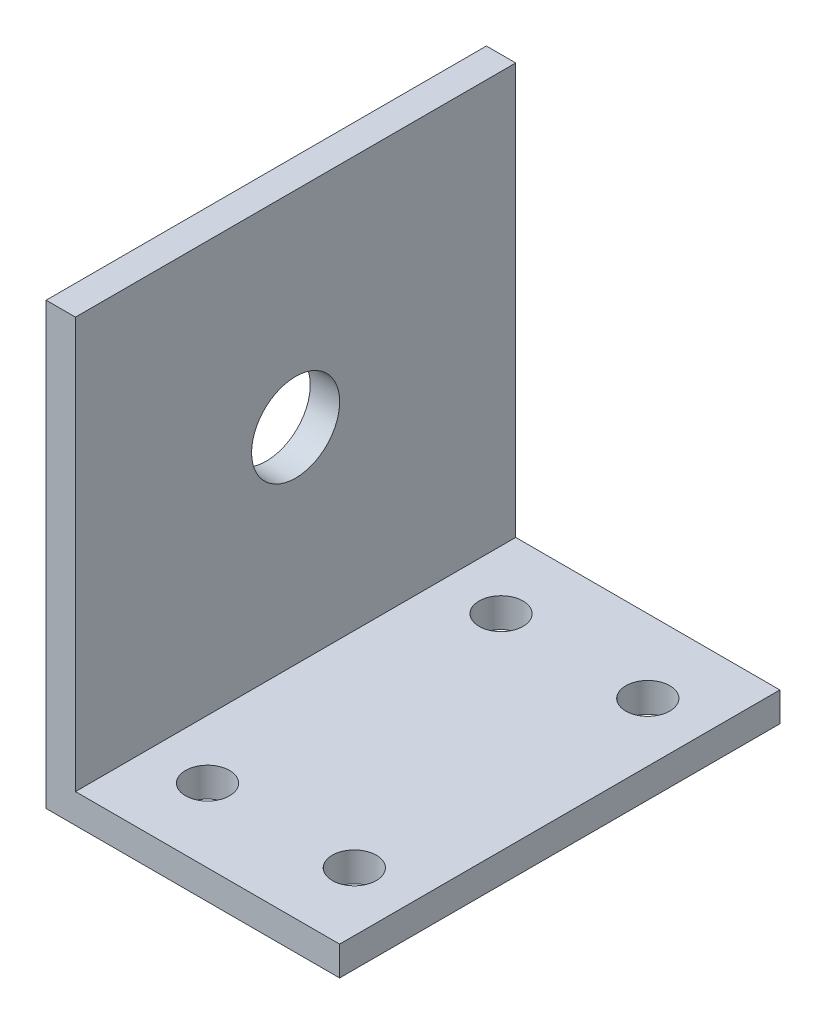
ISO-10303-21;
HEADER;
FILE_DESCRIPTION(('STEP AP214'),'2;1');
FILE_NAME('part.step','',(''),(''),'','','');
FILE_SCHEMA(('AUTOMOTIVE_DESIGN { 1 0 10303 214 1 1 1 1 }'));
ENDSEC;
DATA;
#1=APPLICATION_CONTEXT('core data for automotive mechanical design processes');
#2=APPLICATION_PROTOCOL_DEFINITION('international standard','automotive_design',2000,#1);
#3=PRODUCT_CONTEXT('',#1,'mechanical');
#4=PRODUCT('Part','Part','',(#3));
#5=PRODUCT_RELATED_PRODUCT_CATEGORY('part','',(#4));
#6=PRODUCT_DEFINITION_FORMATION('','',#4);
#7=PRODUCT_DEFINITION_CONTEXT('part definition',#1,'design');
#8=PRODUCT_DEFINITION('design','',#6,#7);
#9=PRODUCT_DEFINITION_SHAPE('','',#8);
#10=(LENGTH_UNIT() NAMED_UNIT(*) SI_UNIT(.MILLI.,.METRE.));
#11=(NAMED_UNIT(*) PLANE_ANGLE_UNIT() SI_UNIT($,.RADIAN.));
#12=(NAMED_UNIT(*) SI_UNIT($,.STERADIAN.) SOLID_ANGLE_UNIT());
#13=UNCERTAINTY_MEASURE_WITH_UNIT(LENGTH_MEASURE(1.E-05),#10,'distance_accuracy_value','');
#14=(GEOMETRIC_REPRESENTATION_CONTEXT(3) GLOBAL_UNCERTAINTY_ASSIGNED_CONTEXT((#13)) GLOBAL_UNIT_ASSIGNED_CONTEXT((#10,
#11,#12)) REPRESENTATION_CONTEXT('',''));
#15=CARTESIAN_POINT('',(0.,0.,0.));
#16=DIRECTION('',(0.,0.,1.));
#17=DIRECTION('',(1.,0.,0.));
#18=AXIS2_PLACEMENT_3D('',#15,#16,#17);
#19=CARTESIAN_POINT('',(0.,0.,20.));
#20=DIRECTION('',(0.,0.,-1.));
#21=DIRECTION('',(-1.,0.,0.));
#22=AXIS2_PLACEMENT_3D('',#19,#20,#21);
#23=PLANE('',#22);
#24=DIRECTION('',(0.,-1.,0.));
#25=VECTOR('',#24,1.);
#26=CARTESIAN_POINT('',(20.,1.99999999999999,20.));
#27=LINE('',#26,#25);
#28=CARTESIAN_POINT('',(20.,1.99999999999999,20.));
#29=VERTEX_POINT('',#28);
#30=CARTESIAN_POINT('',(20.,0.,20.));
#31=VERTEX_POINT('',#30);
#32=EDGE_CURVE('E148',#29,#31,#27,.T.);
#33=ORIENTED_EDGE('',*,*,#32,.F.);
#34=DIRECTION('',(1.,0.,0.));
#35=VECTOR('',#34,1.);
#36=CARTESIAN_POINT('',(3.,1.99999999999999,20.));
#37=LINE('',#36,#35);
#38=CARTESIAN_POINT('',(2.,1.99999999999999,20.));
#39=VERTEX_POINT('',#38);
#40=EDGE_CURVE('E161',#39,#29,#37,.T.);
#41=ORIENTED_EDGE('',*,*,#40,.F.);
#42=DIRECTION('',(0.,-1.,0.));
#43=VECTOR('',#42,1.);
#44=CARTESIAN_POINT('',(2.,30.,20.));
#45=LINE('',#44,#43);
#46=CARTESIAN_POINT('',(2.,30.,20.));
#47=VERTEX_POINT('',#46);
#48=EDGE_CURVE('E119',#47,#39,#45,.T.);
#49=ORIENTED_EDGE('',*,*,#48,.F.);
#50=DIRECTION('',(1.,0.,0.));
#51=VECTOR('',#50,1.);
#52=CARTESIAN_POINT('',(3.,30.,20.));
#53=LINE('',#52,#51);
#54=CARTESIAN_POINT('',(0.,30.,20.));
#55=VERTEX_POINT('',#54);
#56=EDGE_CURVE('E164',#55,#47,#53,.T.);
#57=ORIENTED_EDGE('',*,*,#56,.F.);
#58=DIRECTION('',(0.,-1.,0.));
#59=VECTOR('',#58,1.);
#60=CARTESIAN_POINT('',(0.,0.,20.));
#61=LINE('',#60,#59);
#62=CARTESIAN_POINT('',(0.,0.,20.));
#63=VERTEX_POINT('',#62);
#64=EDGE_CURVE('E67',#55,#63,#61,.T.);
#65=ORIENTED_EDGE('',*,*,#64,.T.);
#66=DIRECTION('',(1.,0.,0.));
#67=VECTOR('',#66,1.);
#68=CARTESIAN_POINT('',(38.,0.,20.));
#69=LINE('',#68,#67);
#70=EDGE_CURVE('E169',#63,#31,#69,.T.);
#71=ORIENTED_EDGE('',*,*,#70,.T.);
#72=EDGE_LOOP('',(#33,#41,#49,#57,#65,#71));
#73=FACE_BOUND('',#72,.T.);
#74=ADVANCED_FACE('F59',(#73),#23,.F.);
#75=CARTESIAN_POINT('',(38.,0.,20.));
#76=DIRECTION('',(0.,1.,0.));
#77=DIRECTION('',(0.,0.,1.));
#78=AXIS2_PLACEMENT_3D('',#75,#76,#77);
#79=PLANE('',#78);
#80=CARTESIAN_POINT('',(16.,0.,-5.));
#81=DIRECTION('',(0.,1.,0.));
#82=DIRECTION('',(0.,0.,1.));
#83=AXIS2_PLACEMENT_3D('',#80,#81,#82);
#84=CIRCLE('',#83,1.5);
#85=CARTESIAN_POINT('',(16.,0.,-3.5));
#86=VERTEX_POINT('',#85);
#87=EDGE_CURVE('E136',#86,#86,#84,.T.);
#88=ORIENTED_EDGE('',*,*,#87,.T.);
#89=EDGE_LOOP('',(#88));
#90=FACE_BOUND('',#89,.T.);
#91=CARTESIAN_POINT('',(6.,0.,15.));
#92=DIRECTION('',(0.,1.,0.));
#93=DIRECTION('',(0.,0.,1.));
#94=AXIS2_PLACEMENT_3D('',#91,#92,#93);
#95=CIRCLE('',#94,1.5);
#96=CARTESIAN_POINT('',(6.,0.,16.5));
#97=VERTEX_POINT('',#96);
#98=EDGE_CURVE('E208',#97,#97,#95,.T.);
#99=ORIENTED_EDGE('',*,*,#98,.T.);
#100=EDGE_LOOP('',(#99));
#101=FACE_BOUND('',#100,.T.);
#102=CARTESIAN_POINT('',(6.,0.,-5.));
#103=DIRECTION('',(0.,1.,0.));
#104=DIRECTION('',(0.,0.,1.));
#105=AXIS2_PLACEMENT_3D('',#102,#103,#104);
#106=CIRCLE('',#105,1.5);
#107=CARTESIAN_POINT('',(6.,0.,-3.5));
#108=VERTEX_POINT('',#107);
#109=EDGE_CURVE('E212',#108,#108,#106,.T.);
#110=ORIENTED_EDGE('',*,*,#109,.T.);
#111=EDGE_LOOP('',(#110));
#112=FACE_BOUND('',#111,.T.);
#113=CARTESIAN_POINT('',(16.,0.,15.));
#114=DIRECTION('',(0.,1.,0.));
#115=DIRECTION('',(0.,0.,1.));
#116=AXIS2_PLACEMENT_3D('',#113,#114,#115);
#117=CIRCLE('',#116,1.5);
#118=CARTESIAN_POINT('',(16.,0.,16.5));
#119=VERTEX_POINT('',#118);
#120=EDGE_CURVE('E215',#119,#119,#117,.T.);
#121=ORIENTED_EDGE('',*,*,#120,.T.);
#122=EDGE_LOOP('',(#121));
#123=FACE_BOUND('',#122,.T.);
#124=DIRECTION('',(0.,0.,-1.));
#125=VECTOR('',#124,1.);
#126=CARTESIAN_POINT('',(20.,0.,20.));
#127=LINE('',#126,#125);
#128=CARTESIAN_POINT('',(20.,0.,-10.));
#129=VERTEX_POINT('',#128);
#130=EDGE_CURVE('E153',#31,#129,#127,.T.);
#131=ORIENTED_EDGE('',*,*,#130,.F.);
#132=ORIENTED_EDGE('',*,*,#70,.F.);
#133=DIRECTION('',(0.,0.,-1.));
#134=VECTOR('',#133,1.);
#135=CARTESIAN_POINT('',(0.,0.,20.));
#136=LINE('',#135,#134);
#137=CARTESIAN_POINT('',(0.,0.,-10.));
#138=VERTEX_POINT('',#137);
#139=EDGE_CURVE('E12',#63,#138,#136,.T.);
#140=ORIENTED_EDGE('',*,*,#139,.T.);
#141=DIRECTION('',(-1.,0.,0.));
#142=VECTOR('',#141,1.);
#143=CARTESIAN_POINT('',(0.,0.,-10.));
#144=LINE('',#143,#142);
#145=EDGE_CURVE('E142',#129,#138,#144,.T.);
#146=ORIENTED_EDGE('',*,*,#145,.F.);
#147=EDGE_LOOP('',(#131,#132,#140,#146));
#148=FACE_BOUND('',#147,.T.);
#149=ADVANCED_FACE('F61',(#90,#101,#112,#123,#148),#79,.F.);
#150=CARTESIAN_POINT('',(0.,1.99999999999999,0.));
#151=DIRECTION('',(0.,-1.,0.));
#152=DIRECTION('',(0.,0.,-1.));
#153=AXIS2_PLACEMENT_3D('',#150,#151,#152);
#154=PLANE('',#153);
#155=CARTESIAN_POINT('',(16.,1.99999999999999,-5.));
#156=DIRECTION('',(0.,1.,0.));
#157=DIRECTION('',(0.,0.,1.));
#158=AXIS2_PLACEMENT_3D('',#155,#156,#157);
#159=CIRCLE('',#158,1.5);
#160=CARTESIAN_POINT('',(16.,1.99999999999999,-3.5));
#161=VERTEX_POINT('',#160);
#162=EDGE_CURVE('E221',#161,#161,#159,.T.);
#163=ORIENTED_EDGE('',*,*,#162,.F.);
#164=EDGE_LOOP('',(#163));
#165=FACE_BOUND('',#164,.T.);
#166=CARTESIAN_POINT('',(6.,1.99999999999999,15.));
#167=DIRECTION('',(0.,1.,0.));
#168=DIRECTION('',(0.,0.,1.));
#169=AXIS2_PLACEMENT_3D('',#166,#167,#168);
#170=CIRCLE('',#169,1.5);
#171=CARTESIAN_POINT('',(6.,1.99999999999999,16.5));
#172=VERTEX_POINT('',#171);
#173=EDGE_CURVE('E224',#172,#172,#170,.T.);
#174=ORIENTED_EDGE('',*,*,#173,.F.);
#175=EDGE_LOOP('',(#174));
#176=FACE_BOUND('',#175,.T.);
#177=CARTESIAN_POINT('',(6.,1.99999999999999,-5.));
#178=DIRECTION('',(0.,1.,0.));
#179=DIRECTION('',(0.,0.,1.));
#180=AXIS2_PLACEMENT_3D('',#177,#178,#179);
#181=CIRCLE('',#180,1.5);
#182=CARTESIAN_POINT('',(6.,1.99999999999999,-3.5));
#183=VERTEX_POINT('',#182);
#184=EDGE_CURVE('E227',#183,#183,#181,.T.);
#185=ORIENTED_EDGE('',*,*,#184,.F.);
#186=EDGE_LOOP('',(#185));
#187=FACE_BOUND('',#186,.T.);
#188=CARTESIAN_POINT('',(16.,1.99999999999999,15.));
#189=DIRECTION('',(0.,1.,0.));
#190=DIRECTION('',(0.,0.,1.));
#191=AXIS2_PLACEMENT_3D('',#188,#189,#190);
#192=CIRCLE('',#191,1.5);
#193=CARTESIAN_POINT('',(16.,1.99999999999999,16.5));
#194=VERTEX_POINT('',#193);
#195=EDGE_CURVE('E217',#194,#194,#192,.T.);
#196=ORIENTED_EDGE('',*,*,#195,.F.);
#197=EDGE_LOOP('',(#196));
#198=FACE_BOUND('',#197,.T.);
#199=DIRECTION('',(0.,0.,1.));
#200=VECTOR('',#199,1.);
#201=CARTESIAN_POINT('',(20.,1.99999999999999,20.));
#202=LINE('',#201,#200);
#203=CARTESIAN_POINT('',(20.,1.99999999999999,-10.));
#204=VERTEX_POINT('',#203);
#205=EDGE_CURVE('E139',#204,#29,#202,.T.);
#206=ORIENTED_EDGE('',*,*,#205,.F.);
#207=DIRECTION('',(1.,0.,0.));
#208=VECTOR('',#207,1.);
#209=CARTESIAN_POINT('',(0.,1.99999999999999,-10.));
#210=LINE('',#209,#208);
#211=CARTESIAN_POINT('',(2.,1.99999999999999,-10.));
#212=VERTEX_POINT('',#211);
#213=EDGE_CURVE('E131',#212,#204,#210,.T.);
#214=ORIENTED_EDGE('',*,*,#213,.F.);
#215=DIRECTION('',(0.,0.,-1.));
#216=VECTOR('',#215,1.);
#217=CARTESIAN_POINT('',(2.,1.99999999999999,20.));
#218=LINE('',#217,#216);
#219=EDGE_CURVE('E113',#39,#212,#218,.T.);
#220=ORIENTED_EDGE('',*,*,#219,.F.);
#221=ORIENTED_EDGE('',*,*,#40,.T.);
#222=EDGE_LOOP('',(#206,#214,#220,#221));
#223=FACE_BOUND('',#222,.T.);
#224=ADVANCED_FACE('F138',(#165,#176,#187,#198,#223),#154,.F.);
#225=CARTESIAN_POINT('',(38.,16.,5.));
#226=DIRECTION('',(-1.,0.,0.));
#227=DIRECTION('',(0.,0.,1.));
#228=AXIS2_PLACEMENT_3D('',#225,#226,#227);
#229=CYLINDRICAL_SURFACE('',#228,3.);
#230=CARTESIAN_POINT('',(0.,16.,5.));
#231=DIRECTION('',(-1.,0.,0.));
#232=DIRECTION('',(0.,0.,1.));
#233=AXIS2_PLACEMENT_3D('',#230,#231,#232);
#234=CIRCLE('',#233,3.);
#235=CARTESIAN_POINT('',(0.,16.,8.));
#236=VERTEX_POINT('',#235);
#237=EDGE_CURVE('E166',#236,#236,#234,.T.);
#238=ORIENTED_EDGE('',*,*,#237,.T.);
#239=EDGE_LOOP('',(#238));
#240=FACE_BOUND('',#239,.T.);
#241=CARTESIAN_POINT('',(2.,16.,5.));
#242=DIRECTION('',(1.,0.,0.));
#243=DIRECTION('',(0.,0.,-1.));
#244=AXIS2_PLACEMENT_3D('',#241,#242,#243);
#245=CIRCLE('',#244,3.);
#246=CARTESIAN_POINT('',(2.,16.,2.));
#247=VERTEX_POINT('',#246);
#248=EDGE_CURVE('E158',#247,#247,#245,.F.);
#249=ORIENTED_EDGE('',*,*,#248,.F.);
#250=EDGE_LOOP('',(#249));
#251=FACE_BOUND('',#250,.T.);
#252=ADVANCED_FACE('F181',(#240,#251),#229,.F.);
#253=CARTESIAN_POINT('',(0.,30.,0.));
#254=DIRECTION('',(0.,1.,0.));
#255=DIRECTION('',(0.,0.,1.));
#256=AXIS2_PLACEMENT_3D('',#253,#254,#255);
#257=PLANE('',#256);
#258=ORIENTED_EDGE('',*,*,#56,.T.);
#259=DIRECTION('',(0.,0.,1.));
#260=VECTOR('',#259,1.);
#261=CARTESIAN_POINT('',(2.,30.,20.));
#262=LINE('',#261,#260);
#263=CARTESIAN_POINT('',(2.,30.,-10.));
#264=VERTEX_POINT('',#263);
#265=EDGE_CURVE('E123',#264,#47,#262,.T.);
#266=ORIENTED_EDGE('',*,*,#265,.F.);
#267=DIRECTION('',(1.,0.,0.));
#268=VECTOR('',#267,1.);
#269=CARTESIAN_POINT('',(0.,30.,-10.));
#270=LINE('',#269,#268);
#271=CARTESIAN_POINT('',(0.,30.,-10.));
#272=VERTEX_POINT('',#271);
#273=EDGE_CURVE('E134',#272,#264,#270,.T.);
#274=ORIENTED_EDGE('',*,*,#273,.F.);
#275=DIRECTION('',(0.,0.,1.));
#276=VECTOR('',#275,1.);
#277=CARTESIAN_POINT('',(0.,30.,20.));
#278=LINE('',#277,#276);
#279=EDGE_CURVE('E81',#272,#55,#278,.T.);
#280=ORIENTED_EDGE('',*,*,#279,.T.);
#281=EDGE_LOOP('',(#258,#266,#274,#280));
#282=FACE_BOUND('',#281,.T.);
#283=ADVANCED_FACE('F179',(#282),#257,.T.);
#284=CARTESIAN_POINT('',(0.,0.,20.));
#285=DIRECTION('',(1.,0.,0.));
#286=DIRECTION('',(0.,0.,-1.));
#287=AXIS2_PLACEMENT_3D('',#284,#285,#286);
#288=PLANE('',#287);
#289=ORIENTED_EDGE('',*,*,#237,.F.);
#290=EDGE_LOOP('',(#289));
#291=FACE_BOUND('',#290,.T.);
#292=ORIENTED_EDGE('',*,*,#279,.F.);
#293=DIRECTION('',(0.,-1.,0.));
#294=VECTOR('',#293,1.);
#295=CARTESIAN_POINT('',(0.,30.,-10.));
#296=LINE('',#295,#294);
#297=EDGE_CURVE('E135',#272,#138,#296,.T.);
#298=ORIENTED_EDGE('',*,*,#297,.T.);
#299=ORIENTED_EDGE('',*,*,#139,.F.);
#300=ORIENTED_EDGE('',*,*,#64,.F.);
#301=EDGE_LOOP('',(#292,#298,#299,#300));
#302=FACE_BOUND('',#301,.T.);
#303=ADVANCED_FACE('F178',(#291,#302),#288,.F.);
#304=CARTESIAN_POINT('',(2.,0.,0.));
#305=DIRECTION('',(1.,0.,0.));
#306=DIRECTION('',(0.,0.,-1.));
#307=AXIS2_PLACEMENT_3D('',#304,#305,#306);
#308=PLANE('',#307);
#309=ORIENTED_EDGE('',*,*,#48,.T.);
#310=ORIENTED_EDGE('',*,*,#219,.T.);
#311=DIRECTION('',(0.,-1.,0.));
#312=VECTOR('',#311,1.);
#313=CARTESIAN_POINT('',(2.,30.,-10.));
#314=LINE('',#313,#312);
#315=EDGE_CURVE('E117',#264,#212,#314,.T.);
#316=ORIENTED_EDGE('',*,*,#315,.F.);
#317=ORIENTED_EDGE('',*,*,#265,.T.);
#318=EDGE_LOOP('',(#309,#310,#316,#317));
#319=FACE_BOUND('',#318,.T.);
#320=ORIENTED_EDGE('',*,*,#248,.T.);
#321=EDGE_LOOP('',(#320));
#322=FACE_BOUND('',#321,.T.);
#323=ADVANCED_FACE('F115',(#319,#322),#308,.T.);
#324=CARTESIAN_POINT('',(20.,0.,0.));
#325=DIRECTION('',(1.,0.,0.));
#326=DIRECTION('',(0.,0.,-1.));
#327=AXIS2_PLACEMENT_3D('',#324,#325,#326);
#328=PLANE('',#327);
#329=ORIENTED_EDGE('',*,*,#32,.T.);
#330=ORIENTED_EDGE('',*,*,#130,.T.);
#331=DIRECTION('',(0.,-1.,0.));
#332=VECTOR('',#331,1.);
#333=CARTESIAN_POINT('',(20.,0.,-10.));
#334=LINE('',#333,#332);
#335=EDGE_CURVE('E140',#204,#129,#334,.T.);
#336=ORIENTED_EDGE('',*,*,#335,.F.);
#337=ORIENTED_EDGE('',*,*,#205,.T.);
#338=EDGE_LOOP('',(#329,#330,#336,#337));
#339=FACE_BOUND('',#338,.T.);
#340=ADVANCED_FACE('F176',(#339),#328,.T.);
#341=CARTESIAN_POINT('',(0.,0.,-10.));
#342=DIRECTION('',(0.,0.,-1.));
#343=DIRECTION('',(-1.,0.,0.));
#344=AXIS2_PLACEMENT_3D('',#341,#342,#343);
#345=PLANE('',#344);
#346=ORIENTED_EDGE('',*,*,#145,.T.);
#347=ORIENTED_EDGE('',*,*,#297,.F.);
#348=ORIENTED_EDGE('',*,*,#273,.T.);
#349=ORIENTED_EDGE('',*,*,#315,.T.);
#350=ORIENTED_EDGE('',*,*,#213,.T.);
#351=ORIENTED_EDGE('',*,*,#335,.T.);
#352=EDGE_LOOP('',(#346,#347,#348,#349,#350,#351));
#353=FACE_BOUND('',#352,.T.);
#354=ADVANCED_FACE('F129',(#353),#345,.T.);
#355=CARTESIAN_POINT('',(16.,-8.00000000000001,15.));
#356=DIRECTION('',(0.,1.,0.));
#357=DIRECTION('',(0.,0.,1.));
#358=AXIS2_PLACEMENT_3D('',#355,#356,#357);
#359=CYLINDRICAL_SURFACE('',#358,1.5);
#360=ORIENTED_EDGE('',*,*,#195,.T.);
#361=EDGE_LOOP('',(#360));
#362=FACE_BOUND('',#361,.T.);
#363=ORIENTED_EDGE('',*,*,#120,.F.);
#364=EDGE_LOOP('',(#363));
#365=FACE_BOUND('',#364,.T.);
#366=ADVANCED_FACE('F239',(#362,#365),#359,.F.);
#367=CARTESIAN_POINT('',(6.,-8.00000000000001,-5.));
#368=DIRECTION('',(0.,1.,0.));
#369=DIRECTION('',(0.,0.,1.));
#370=AXIS2_PLACEMENT_3D('',#367,#368,#369);
#371=CYLINDRICAL_SURFACE('',#370,1.5);
#372=ORIENTED_EDGE('',*,*,#184,.T.);
#373=EDGE_LOOP('',(#372));
#374=FACE_BOUND('',#373,.T.);
#375=ORIENTED_EDGE('',*,*,#109,.F.);
#376=EDGE_LOOP('',(#375));
#377=FACE_BOUND('',#376,.T.);
#378=ADVANCED_FACE('F233',(#374,#377),#371,.F.);
#379=CARTESIAN_POINT('',(6.,-8.00000000000001,15.));
#380=DIRECTION('',(0.,1.,0.));
#381=DIRECTION('',(0.,0.,1.));
#382=AXIS2_PLACEMENT_3D('',#379,#380,#381);
#383=CYLINDRICAL_SURFACE('',#382,1.5);
#384=ORIENTED_EDGE('',*,*,#173,.T.);
#385=EDGE_LOOP('',(#384));
#386=FACE_BOUND('',#385,.T.);
#387=ORIENTED_EDGE('',*,*,#98,.F.);
#388=EDGE_LOOP('',(#387));
#389=FACE_BOUND('',#388,.T.);
#390=ADVANCED_FACE('F246',(#386,#389),#383,.F.);
#391=CARTESIAN_POINT('',(16.,-8.00000000000001,-5.));
#392=DIRECTION('',(0.,1.,0.));
#393=DIRECTION('',(0.,0.,1.));
#394=AXIS2_PLACEMENT_3D('',#391,#392,#393);
#395=CYLINDRICAL_SURFACE('',#394,1.5);
#396=ORIENTED_EDGE('',*,*,#162,.T.);
#397=EDGE_LOOP('',(#396));
#398=FACE_BOUND('',#397,.T.);
#399=ORIENTED_EDGE('',*,*,#87,.F.);
#400=EDGE_LOOP('',(#399));
#401=FACE_BOUND('',#400,.T.);
#402=ADVANCED_FACE('F300',(#398,#401),#395,.F.);
#403=CLOSED_SHELL('',(#74,#149,#224,#252,#283,#303,#323,#340,#354,#366,#378,#390,#402));
#404=MANIFOLD_SOLID_BREP('B2',#403);
#405=ADVANCED_BREP_SHAPE_REPRESENTATION('',(#18,#404),#14);
#406=SHAPE_DEFINITION_REPRESENTATION(#9,#405);
ENDSEC;
END-ISO-10303-21;
